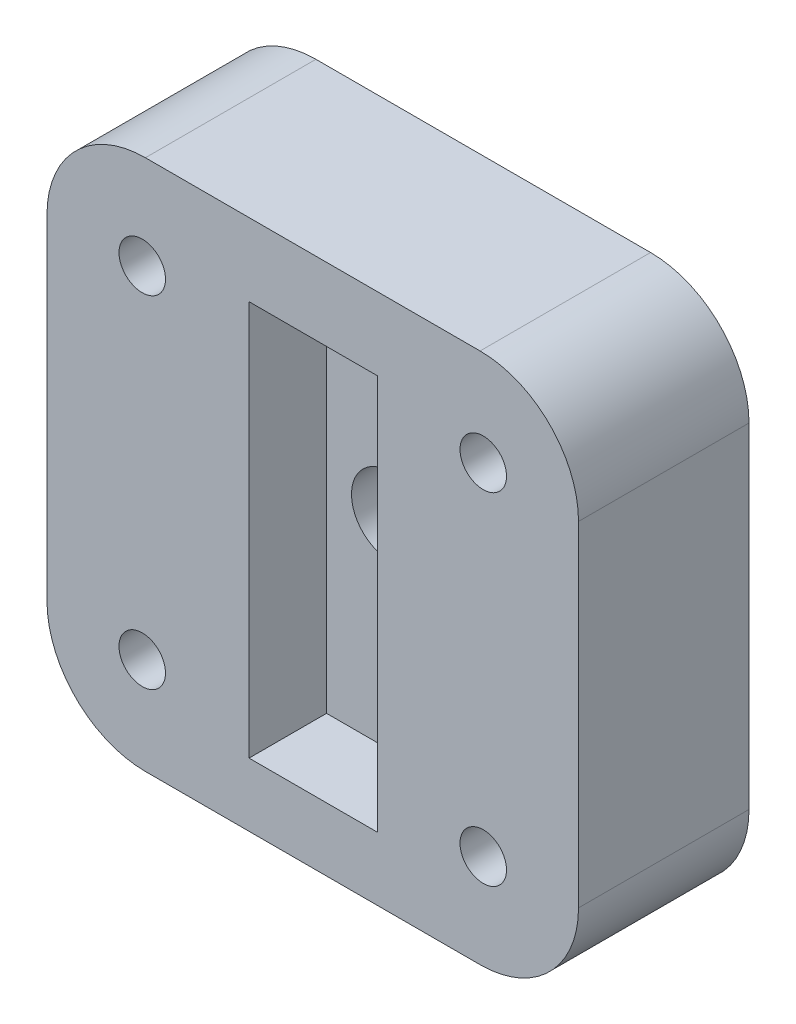
ISO-10303-21;
HEADER;
FILE_DESCRIPTION(('STEP AP214'),'2;1');
FILE_NAME('part.step','',(''),(''),'','','');
FILE_SCHEMA(('AUTOMOTIVE_DESIGN { 1 0 10303 214 1 1 1 1 }'));
ENDSEC;
DATA;
#1=APPLICATION_CONTEXT('core data for automotive mechanical design processes');
#2=APPLICATION_PROTOCOL_DEFINITION('international standard','automotive_design',2000,#1);
#3=PRODUCT_CONTEXT('',#1,'mechanical');
#4=PRODUCT('Part','Part','',(#3));
#5=PRODUCT_RELATED_PRODUCT_CATEGORY('part','',(#4));
#6=PRODUCT_DEFINITION_FORMATION('','',#4);
#7=PRODUCT_DEFINITION_CONTEXT('part definition',#1,'design');
#8=PRODUCT_DEFINITION('design','',#6,#7);
#9=PRODUCT_DEFINITION_SHAPE('','',#8);
#10=(LENGTH_UNIT() NAMED_UNIT(*) SI_UNIT(.MILLI.,.METRE.));
#11=(NAMED_UNIT(*) PLANE_ANGLE_UNIT() SI_UNIT($,.RADIAN.));
#12=(NAMED_UNIT(*) SI_UNIT($,.STERADIAN.) SOLID_ANGLE_UNIT());
#13=UNCERTAINTY_MEASURE_WITH_UNIT(LENGTH_MEASURE(1.E-05),#10,'distance_accuracy_value','');
#14=(GEOMETRIC_REPRESENTATION_CONTEXT(3) GLOBAL_UNCERTAINTY_ASSIGNED_CONTEXT((#13)) GLOBAL_UNIT_ASSIGNED_CONTEXT((#10,
#11,#12)) REPRESENTATION_CONTEXT('',''));
#15=CARTESIAN_POINT('',(0.,0.,0.));
#16=DIRECTION('',(0.,0.,1.));
#17=DIRECTION('',(1.,0.,0.));
#18=AXIS2_PLACEMENT_3D('',#15,#16,#17);
#19=CARTESIAN_POINT('',(0.,0.,0.999999999999999));
#20=DIRECTION('',(0.,0.,1.));
#21=DIRECTION('',(1.,0.,0.));
#22=AXIS2_PLACEMENT_3D('',#19,#20,#21);
#23=CYLINDRICAL_SURFACE('',#22,2.5);
#24=CARTESIAN_POINT('',(0.,0.,6.));
#25=DIRECTION('',(0.,0.,1.));
#26=DIRECTION('',(1.,0.,0.));
#27=AXIS2_PLACEMENT_3D('',#24,#25,#26);
#28=CIRCLE('',#27,2.5);
#29=CARTESIAN_POINT('',(2.5,0.,6.));
#30=VERTEX_POINT('',#29);
#31=EDGE_CURVE('E153',#30,#30,#28,.T.);
#32=ORIENTED_EDGE('',*,*,#31,.T.);
#33=EDGE_LOOP('',(#32));
#34=FACE_BOUND('',#33,.T.);
#35=CARTESIAN_POINT('',(0.,0.,3.));
#36=DIRECTION('',(0.,0.,-1.));
#37=DIRECTION('',(-1.,0.,0.));
#38=AXIS2_PLACEMENT_3D('',#35,#36,#37);
#39=CIRCLE('',#38,2.5);
#40=CARTESIAN_POINT('',(-2.5,0.,3.));
#41=VERTEX_POINT('',#40);
#42=EDGE_CURVE('E215',#41,#41,#39,.F.);
#43=ORIENTED_EDGE('',*,*,#42,.F.);
#44=EDGE_LOOP('',(#43));
#45=FACE_BOUND('',#44,.T.);
#46=ADVANCED_FACE('F32',(#34,#45),#23,.F.);
#47=CARTESIAN_POINT('',(17.145,0.,11.));
#48=DIRECTION('',(1.,0.,0.));
#49=DIRECTION('',(0.,0.,-1.));
#50=AXIS2_PLACEMENT_3D('',#47,#48,#49);
#51=PLANE('',#50);
#52=DIRECTION('',(0.,-1.,0.));
#53=VECTOR('',#52,1.);
#54=CARTESIAN_POINT('',(17.145,0.,11.));
#55=LINE('',#54,#53);
#56=CARTESIAN_POINT('',(17.145,10.795,11.));
#57=VERTEX_POINT('',#56);
#58=CARTESIAN_POINT('',(17.145,-10.795,11.));
#59=VERTEX_POINT('',#58);
#60=EDGE_CURVE('E182',#57,#59,#55,.T.);
#61=ORIENTED_EDGE('',*,*,#60,.T.);
#62=DIRECTION('',(0.,0.,-1.));
#63=VECTOR('',#62,1.);
#64=CARTESIAN_POINT('',(17.145,-10.795,0.));
#65=LINE('',#64,#63);
#66=CARTESIAN_POINT('',(17.145,-10.795,0.));
#67=VERTEX_POINT('',#66);
#68=EDGE_CURVE('E220',#59,#67,#65,.T.);
#69=ORIENTED_EDGE('',*,*,#68,.T.);
#70=DIRECTION('',(0.,-1.,0.));
#71=VECTOR('',#70,1.);
#72=CARTESIAN_POINT('',(17.145,0.,0.));
#73=LINE('',#72,#71);
#74=CARTESIAN_POINT('',(17.145,10.795,0.));
#75=VERTEX_POINT('',#74);
#76=EDGE_CURVE('E205',#75,#67,#73,.T.);
#77=ORIENTED_EDGE('',*,*,#76,.F.);
#78=DIRECTION('',(0.,0.,-1.));
#79=VECTOR('',#78,1.);
#80=CARTESIAN_POINT('',(17.145,10.795,11.));
#81=LINE('',#80,#79);
#82=EDGE_CURVE('E193',#75,#57,#81,.F.);
#83=ORIENTED_EDGE('',*,*,#82,.T.);
#84=EDGE_LOOP('',(#61,#69,#77,#83));
#85=FACE_BOUND('',#84,.T.);
#86=ADVANCED_FACE('F275',(#85),#51,.T.);
#87=CARTESIAN_POINT('',(0.,17.145,11.));
#88=DIRECTION('',(0.,1.,0.));
#89=DIRECTION('',(0.,0.,1.));
#90=AXIS2_PLACEMENT_3D('',#87,#88,#89);
#91=PLANE('',#90);
#92=DIRECTION('',(1.,0.,0.));
#93=VECTOR('',#92,1.);
#94=CARTESIAN_POINT('',(0.,17.145,11.));
#95=LINE('',#94,#93);
#96=CARTESIAN_POINT('',(-10.795,17.145,11.));
#97=VERTEX_POINT('',#96);
#98=CARTESIAN_POINT('',(10.795,17.145,11.));
#99=VERTEX_POINT('',#98);
#100=EDGE_CURVE('E185',#97,#99,#95,.T.);
#101=ORIENTED_EDGE('',*,*,#100,.T.);
#102=DIRECTION('',(0.,0.,-1.));
#103=VECTOR('',#102,1.);
#104=CARTESIAN_POINT('',(10.795,17.145,11.));
#105=LINE('',#104,#103);
#106=CARTESIAN_POINT('',(10.795,17.145,0.));
#107=VERTEX_POINT('',#106);
#108=EDGE_CURVE('E11',#99,#107,#105,.T.);
#109=ORIENTED_EDGE('',*,*,#108,.T.);
#110=DIRECTION('',(1.,0.,0.));
#111=VECTOR('',#110,1.);
#112=CARTESIAN_POINT('',(0.,17.145,0.));
#113=LINE('',#112,#111);
#114=CARTESIAN_POINT('',(-10.795,17.145,0.));
#115=VERTEX_POINT('',#114);
#116=EDGE_CURVE('E208',#115,#107,#113,.T.);
#117=ORIENTED_EDGE('',*,*,#116,.F.);
#118=DIRECTION('',(0.,0.,-1.));
#119=VECTOR('',#118,1.);
#120=CARTESIAN_POINT('',(-10.795,17.145,11.));
#121=LINE('',#120,#119);
#122=EDGE_CURVE('E40',#115,#97,#121,.F.);
#123=ORIENTED_EDGE('',*,*,#122,.T.);
#124=EDGE_LOOP('',(#101,#109,#117,#123));
#125=FACE_BOUND('',#124,.T.);
#126=ADVANCED_FACE('F249',(#125),#91,.T.);
#127=CARTESIAN_POINT('',(-17.145,0.,11.));
#128=DIRECTION('',(1.,0.,0.));
#129=DIRECTION('',(0.,1.,0.));
#130=AXIS2_PLACEMENT_3D('',#127,#128,#129);
#131=PLANE('',#130);
#132=DIRECTION('',(0.,-1.,0.));
#133=VECTOR('',#132,1.);
#134=CARTESIAN_POINT('',(-17.145,0.,0.));
#135=LINE('',#134,#133);
#136=CARTESIAN_POINT('',(-17.145,10.795,0.));
#137=VERTEX_POINT('',#136);
#138=CARTESIAN_POINT('',(-17.145,-10.795,0.));
#139=VERTEX_POINT('',#138);
#140=EDGE_CURVE('E211',#137,#139,#135,.T.);
#141=ORIENTED_EDGE('',*,*,#140,.T.);
#142=DIRECTION('',(0.,0.,-1.));
#143=VECTOR('',#142,1.);
#144=CARTESIAN_POINT('',(-17.145,-10.795,11.));
#145=LINE('',#144,#143);
#146=CARTESIAN_POINT('',(-17.145,-10.795,11.));
#147=VERTEX_POINT('',#146);
#148=EDGE_CURVE('E47',#139,#147,#145,.F.);
#149=ORIENTED_EDGE('',*,*,#148,.T.);
#150=DIRECTION('',(0.,-1.,0.));
#151=VECTOR('',#150,1.);
#152=CARTESIAN_POINT('',(-17.145,0.,11.));
#153=LINE('',#152,#151);
#154=CARTESIAN_POINT('',(-17.145,10.795,11.));
#155=VERTEX_POINT('',#154);
#156=EDGE_CURVE('E188',#155,#147,#153,.T.);
#157=ORIENTED_EDGE('',*,*,#156,.F.);
#158=DIRECTION('',(0.,0.,-1.));
#159=VECTOR('',#158,1.);
#160=CARTESIAN_POINT('',(-17.145,10.795,0.));
#161=LINE('',#160,#159);
#162=EDGE_CURVE('E243',#155,#137,#161,.T.);
#163=ORIENTED_EDGE('',*,*,#162,.T.);
#164=EDGE_LOOP('',(#141,#149,#157,#163));
#165=FACE_BOUND('',#164,.T.);
#166=ADVANCED_FACE('F257',(#165),#131,.F.);
#167=CARTESIAN_POINT('',(11.,11.,11.));
#168=DIRECTION('',(0.,0.,-1.));
#169=DIRECTION('',(-1.,0.,0.));
#170=AXIS2_PLACEMENT_3D('',#167,#168,#169);
#171=CYLINDRICAL_SURFACE('',#170,1.5);
#172=CARTESIAN_POINT('',(11.,11.,11.));
#173=DIRECTION('',(0.,0.,1.));
#174=DIRECTION('',(1.,0.,0.));
#175=AXIS2_PLACEMENT_3D('',#172,#173,#174);
#176=CIRCLE('',#175,1.5);
#177=CARTESIAN_POINT('',(12.5,11.,11.));
#178=VERTEX_POINT('',#177);
#179=EDGE_CURVE('E179',#178,#178,#176,.T.);
#180=ORIENTED_EDGE('',*,*,#179,.T.);
#181=EDGE_LOOP('',(#180));
#182=FACE_BOUND('',#181,.T.);
#183=CARTESIAN_POINT('',(11.,11.,0.));
#184=DIRECTION('',(0.,0.,1.));
#185=DIRECTION('',(1.,0.,0.));
#186=AXIS2_PLACEMENT_3D('',#183,#184,#185);
#187=CIRCLE('',#186,1.5);
#188=CARTESIAN_POINT('',(12.5,11.,0.));
#189=VERTEX_POINT('',#188);
#190=EDGE_CURVE('E202',#189,#189,#187,.T.);
#191=ORIENTED_EDGE('',*,*,#190,.F.);
#192=EDGE_LOOP('',(#191));
#193=FACE_BOUND('',#192,.T.);
#194=ADVANCED_FACE('F325',(#182,#193),#171,.F.);
#195=CARTESIAN_POINT('',(11.,-11.,11.));
#196=DIRECTION('',(0.,0.,-1.));
#197=DIRECTION('',(-1.,0.,0.));
#198=AXIS2_PLACEMENT_3D('',#195,#196,#197);
#199=CYLINDRICAL_SURFACE('',#198,1.5);
#200=CARTESIAN_POINT('',(11.,-11.,11.));
#201=DIRECTION('',(0.,0.,1.));
#202=DIRECTION('',(1.,0.,0.));
#203=AXIS2_PLACEMENT_3D('',#200,#201,#202);
#204=CIRCLE('',#203,1.5);
#205=CARTESIAN_POINT('',(12.5,-11.,11.));
#206=VERTEX_POINT('',#205);
#207=EDGE_CURVE('E176',#206,#206,#204,.T.);
#208=ORIENTED_EDGE('',*,*,#207,.T.);
#209=EDGE_LOOP('',(#208));
#210=FACE_BOUND('',#209,.T.);
#211=CARTESIAN_POINT('',(11.,-11.,0.));
#212=DIRECTION('',(0.,0.,1.));
#213=DIRECTION('',(1.,0.,0.));
#214=AXIS2_PLACEMENT_3D('',#211,#212,#213);
#215=CIRCLE('',#214,1.5);
#216=CARTESIAN_POINT('',(12.5,-11.,0.));
#217=VERTEX_POINT('',#216);
#218=EDGE_CURVE('E199',#217,#217,#215,.T.);
#219=ORIENTED_EDGE('',*,*,#218,.F.);
#220=EDGE_LOOP('',(#219));
#221=FACE_BOUND('',#220,.T.);
#222=ADVANCED_FACE('F330',(#210,#221),#199,.F.);
#223=CARTESIAN_POINT('',(-11.,11.,11.));
#224=DIRECTION('',(0.,0.,-1.));
#225=DIRECTION('',(-1.,0.,0.));
#226=AXIS2_PLACEMENT_3D('',#223,#224,#225);
#227=CYLINDRICAL_SURFACE('',#226,1.5);
#228=CARTESIAN_POINT('',(-11.,11.,11.));
#229=DIRECTION('',(0.,0.,1.));
#230=DIRECTION('',(1.,0.,0.));
#231=AXIS2_PLACEMENT_3D('',#228,#229,#230);
#232=CIRCLE('',#231,1.5);
#233=CARTESIAN_POINT('',(-9.5,11.,11.));
#234=VERTEX_POINT('',#233);
#235=EDGE_CURVE('E172',#234,#234,#232,.T.);
#236=ORIENTED_EDGE('',*,*,#235,.T.);
#237=EDGE_LOOP('',(#236));
#238=FACE_BOUND('',#237,.T.);
#239=CARTESIAN_POINT('',(-11.,11.,0.));
#240=DIRECTION('',(0.,0.,1.));
#241=DIRECTION('',(1.,0.,0.));
#242=AXIS2_PLACEMENT_3D('',#239,#240,#241);
#243=CIRCLE('',#242,1.5);
#244=CARTESIAN_POINT('',(-9.5,11.,0.));
#245=VERTEX_POINT('',#244);
#246=EDGE_CURVE('E196',#245,#245,#243,.T.);
#247=ORIENTED_EDGE('',*,*,#246,.F.);
#248=EDGE_LOOP('',(#247));
#249=FACE_BOUND('',#248,.T.);
#250=ADVANCED_FACE('F334',(#238,#249),#227,.F.);
#251=CARTESIAN_POINT('',(-11.,-11.,11.));
#252=DIRECTION('',(0.,0.,-1.));
#253=DIRECTION('',(-1.,0.,0.));
#254=AXIS2_PLACEMENT_3D('',#251,#252,#253);
#255=CYLINDRICAL_SURFACE('',#254,1.5);
#256=CARTESIAN_POINT('',(-11.,-11.,11.));
#257=DIRECTION('',(0.,0.,1.));
#258=DIRECTION('',(1.,0.,0.));
#259=AXIS2_PLACEMENT_3D('',#256,#257,#258);
#260=CIRCLE('',#259,1.5);
#261=CARTESIAN_POINT('',(-9.5,-11.,11.));
#262=VERTEX_POINT('',#261);
#263=EDGE_CURVE('E169',#262,#262,#260,.T.);
#264=ORIENTED_EDGE('',*,*,#263,.T.);
#265=EDGE_LOOP('',(#264));
#266=FACE_BOUND('',#265,.T.);
#267=CARTESIAN_POINT('',(-11.,-11.,0.));
#268=DIRECTION('',(0.,0.,1.));
#269=DIRECTION('',(1.,0.,0.));
#270=AXIS2_PLACEMENT_3D('',#267,#268,#269);
#271=CIRCLE('',#270,1.5);
#272=CARTESIAN_POINT('',(-9.5,-11.,0.));
#273=VERTEX_POINT('',#272);
#274=EDGE_CURVE('E165',#273,#273,#271,.T.);
#275=ORIENTED_EDGE('',*,*,#274,.F.);
#276=EDGE_LOOP('',(#275));
#277=FACE_BOUND('',#276,.T.);
#278=ADVANCED_FACE('F322',(#266,#277),#255,.F.);
#279=CARTESIAN_POINT('',(0.,-17.145,11.));
#280=DIRECTION('',(0.,1.,0.));
#281=DIRECTION('',(0.,0.,1.));
#282=AXIS2_PLACEMENT_3D('',#279,#280,#281);
#283=PLANE('',#282);
#284=DIRECTION('',(1.,0.,0.));
#285=VECTOR('',#284,1.);
#286=CARTESIAN_POINT('',(0.,-17.145,0.));
#287=LINE('',#286,#285);
#288=CARTESIAN_POINT('',(-10.795,-17.145,0.));
#289=VERTEX_POINT('',#288);
#290=CARTESIAN_POINT('',(10.795,-17.145,0.));
#291=VERTEX_POINT('',#290);
#292=EDGE_CURVE('E173',#289,#291,#287,.T.);
#293=ORIENTED_EDGE('',*,*,#292,.T.);
#294=DIRECTION('',(0.,0.,-1.));
#295=VECTOR('',#294,1.);
#296=CARTESIAN_POINT('',(10.795,-17.145,11.));
#297=LINE('',#296,#295);
#298=CARTESIAN_POINT('',(10.795,-17.145,11.));
#299=VERTEX_POINT('',#298);
#300=EDGE_CURVE('E234',#291,#299,#297,.F.);
#301=ORIENTED_EDGE('',*,*,#300,.T.);
#302=DIRECTION('',(1.,0.,0.));
#303=VECTOR('',#302,1.);
#304=CARTESIAN_POINT('',(0.,-17.145,11.));
#305=LINE('',#304,#303);
#306=CARTESIAN_POINT('',(-10.795,-17.145,11.));
#307=VERTEX_POINT('',#306);
#308=EDGE_CURVE('E190',#307,#299,#305,.T.);
#309=ORIENTED_EDGE('',*,*,#308,.F.);
#310=DIRECTION('',(0.,0.,-1.));
#311=VECTOR('',#310,1.);
#312=CARTESIAN_POINT('',(-10.795,-17.145,11.));
#313=LINE('',#312,#311);
#314=EDGE_CURVE('E231',#307,#289,#313,.T.);
#315=ORIENTED_EDGE('',*,*,#314,.T.);
#316=EDGE_LOOP('',(#293,#301,#309,#315));
#317=FACE_BOUND('',#316,.T.);
#318=ADVANCED_FACE('F267',(#317),#283,.F.);
#319=CARTESIAN_POINT('',(0.,0.,11.));
#320=DIRECTION('',(0.,0.,1.));
#321=DIRECTION('',(1.,0.,0.));
#322=AXIS2_PLACEMENT_3D('',#319,#320,#321);
#323=PLANE('',#322);
#324=DIRECTION('',(0.,-1.,0.));
#325=VECTOR('',#324,1.);
#326=CARTESIAN_POINT('',(-4.109,12.446,11.));
#327=LINE('',#326,#325);
#328=CARTESIAN_POINT('',(-4.109,12.446,11.));
#329=VERTEX_POINT('',#328);
#330=CARTESIAN_POINT('',(-4.109,-13.054,11.));
#331=VERTEX_POINT('',#330);
#332=EDGE_CURVE('E130',#329,#331,#327,.T.);
#333=ORIENTED_EDGE('',*,*,#332,.F.);
#334=DIRECTION('',(-1.,0.,0.));
#335=VECTOR('',#334,1.);
#336=CARTESIAN_POINT('',(-4.109,12.446,11.));
#337=LINE('',#336,#335);
#338=CARTESIAN_POINT('',(4.191,12.446,11.));
#339=VERTEX_POINT('',#338);
#340=EDGE_CURVE('E147',#339,#329,#337,.T.);
#341=ORIENTED_EDGE('',*,*,#340,.F.);
#342=DIRECTION('',(0.,1.,0.));
#343=VECTOR('',#342,1.);
#344=CARTESIAN_POINT('',(4.191,12.446,11.));
#345=LINE('',#344,#343);
#346=CARTESIAN_POINT('',(4.191,-13.054,11.));
#347=VERTEX_POINT('',#346);
#348=EDGE_CURVE('E150',#347,#339,#345,.T.);
#349=ORIENTED_EDGE('',*,*,#348,.F.);
#350=DIRECTION('',(1.,0.,0.));
#351=VECTOR('',#350,1.);
#352=CARTESIAN_POINT('',(-4.109,-13.054,11.));
#353=LINE('',#352,#351);
#354=EDGE_CURVE('E159',#331,#347,#353,.T.);
#355=ORIENTED_EDGE('',*,*,#354,.F.);
#356=EDGE_LOOP('',(#333,#341,#349,#355));
#357=FACE_BOUND('',#356,.T.);
#358=ORIENTED_EDGE('',*,*,#263,.F.);
#359=EDGE_LOOP('',(#358));
#360=FACE_BOUND('',#359,.T.);
#361=ORIENTED_EDGE('',*,*,#235,.F.);
#362=EDGE_LOOP('',(#361));
#363=FACE_BOUND('',#362,.T.);
#364=ORIENTED_EDGE('',*,*,#207,.F.);
#365=EDGE_LOOP('',(#364));
#366=FACE_BOUND('',#365,.T.);
#367=ORIENTED_EDGE('',*,*,#179,.F.);
#368=EDGE_LOOP('',(#367));
#369=FACE_BOUND('',#368,.T.);
#370=ORIENTED_EDGE('',*,*,#308,.T.);
#371=CARTESIAN_POINT('',(10.795,-10.795,11.));
#372=DIRECTION('',(0.,0.,1.));
#373=DIRECTION('',(1.,0.,0.));
#374=AXIS2_PLACEMENT_3D('',#371,#372,#373);
#375=CIRCLE('',#374,6.35);
#376=EDGE_CURVE('E241',#299,#59,#375,.T.);
#377=ORIENTED_EDGE('',*,*,#376,.T.);
#378=ORIENTED_EDGE('',*,*,#60,.F.);
#379=CARTESIAN_POINT('',(10.795,10.795,11.));
#380=DIRECTION('',(0.,0.,1.));
#381=DIRECTION('',(1.,0.,0.));
#382=AXIS2_PLACEMENT_3D('',#379,#380,#381);
#383=CIRCLE('',#382,6.35);
#384=EDGE_CURVE('E237',#57,#99,#383,.T.);
#385=ORIENTED_EDGE('',*,*,#384,.T.);
#386=ORIENTED_EDGE('',*,*,#100,.F.);
#387=CARTESIAN_POINT('',(-10.795,10.795,11.));
#388=DIRECTION('',(0.,0.,1.));
#389=DIRECTION('',(1.,0.,0.));
#390=AXIS2_PLACEMENT_3D('',#387,#388,#389);
#391=CIRCLE('',#390,6.35);
#392=EDGE_CURVE('E54',#97,#155,#391,.T.);
#393=ORIENTED_EDGE('',*,*,#392,.T.);
#394=ORIENTED_EDGE('',*,*,#156,.T.);
#395=CARTESIAN_POINT('',(-10.795,-10.795,11.));
#396=DIRECTION('',(0.,0.,1.));
#397=DIRECTION('',(1.,0.,0.));
#398=AXIS2_PLACEMENT_3D('',#395,#396,#397);
#399=CIRCLE('',#398,6.35);
#400=EDGE_CURVE('E239',#147,#307,#399,.T.);
#401=ORIENTED_EDGE('',*,*,#400,.T.);
#402=EDGE_LOOP('',(#370,#377,#378,#385,#386,#393,#394,#401));
#403=FACE_BOUND('',#402,.T.);
#404=ADVANCED_FACE('F252',(#357,#360,#363,#366,#369,#403),#323,.T.);
#405=CARTESIAN_POINT('',(0.,0.,0.));
#406=DIRECTION('',(0.,0.,1.));
#407=DIRECTION('',(1.,0.,0.));
#408=AXIS2_PLACEMENT_3D('',#405,#406,#407);
#409=PLANE('',#408);
#410=CARTESIAN_POINT('',(0.,0.,0.));
#411=DIRECTION('',(0.,0.,-1.));
#412=DIRECTION('',(-1.,0.,0.));
#413=AXIS2_PLACEMENT_3D('',#410,#411,#412);
#414=CIRCLE('',#413,4.15);
#415=CARTESIAN_POINT('',(-4.15,0.,0.));
#416=VERTEX_POINT('',#415);
#417=EDGE_CURVE('E356',#416,#416,#414,.T.);
#418=ORIENTED_EDGE('',*,*,#417,.F.);
#419=EDGE_LOOP('',(#418));
#420=FACE_BOUND('',#419,.T.);
#421=ORIENTED_EDGE('',*,*,#274,.T.);
#422=EDGE_LOOP('',(#421));
#423=FACE_BOUND('',#422,.T.);
#424=ORIENTED_EDGE('',*,*,#246,.T.);
#425=EDGE_LOOP('',(#424));
#426=FACE_BOUND('',#425,.T.);
#427=ORIENTED_EDGE('',*,*,#218,.T.);
#428=EDGE_LOOP('',(#427));
#429=FACE_BOUND('',#428,.T.);
#430=ORIENTED_EDGE('',*,*,#190,.T.);
#431=EDGE_LOOP('',(#430));
#432=FACE_BOUND('',#431,.T.);
#433=ORIENTED_EDGE('',*,*,#76,.T.);
#434=CARTESIAN_POINT('',(10.795,-10.795,0.));
#435=DIRECTION('',(0.,0.,1.));
#436=DIRECTION('',(1.,0.,0.));
#437=AXIS2_PLACEMENT_3D('',#434,#435,#436);
#438=CIRCLE('',#437,6.35);
#439=EDGE_CURVE('E229',#67,#291,#438,.F.);
#440=ORIENTED_EDGE('',*,*,#439,.T.);
#441=ORIENTED_EDGE('',*,*,#292,.F.);
#442=CARTESIAN_POINT('',(-10.795,-10.795,0.));
#443=DIRECTION('',(0.,0.,1.));
#444=DIRECTION('',(1.,0.,0.));
#445=AXIS2_PLACEMENT_3D('',#442,#443,#444);
#446=CIRCLE('',#445,6.35);
#447=EDGE_CURVE('E227',#289,#139,#446,.F.);
#448=ORIENTED_EDGE('',*,*,#447,.T.);
#449=ORIENTED_EDGE('',*,*,#140,.F.);
#450=CARTESIAN_POINT('',(-10.795,10.795,0.));
#451=DIRECTION('',(0.,0.,1.));
#452=DIRECTION('',(1.,0.,0.));
#453=AXIS2_PLACEMENT_3D('',#450,#451,#452);
#454=CIRCLE('',#453,6.35);
#455=EDGE_CURVE('E223',#137,#115,#454,.F.);
#456=ORIENTED_EDGE('',*,*,#455,.T.);
#457=ORIENTED_EDGE('',*,*,#116,.T.);
#458=CARTESIAN_POINT('',(10.795,10.795,0.));
#459=DIRECTION('',(0.,0.,1.));
#460=DIRECTION('',(1.,0.,0.));
#461=AXIS2_PLACEMENT_3D('',#458,#459,#460);
#462=CIRCLE('',#461,6.35);
#463=EDGE_CURVE('E225',#107,#75,#462,.F.);
#464=ORIENTED_EDGE('',*,*,#463,.T.);
#465=EDGE_LOOP('',(#433,#440,#441,#448,#449,#456,#457,#464));
#466=FACE_BOUND('',#465,.T.);
#467=ADVANCED_FACE('F259',(#420,#423,#426,#429,#432,#466),#409,.F.);
#468=CARTESIAN_POINT('',(-4.109,12.446,6.));
#469=DIRECTION('',(-1.,0.,0.));
#470=DIRECTION('',(0.,-1.,0.));
#471=AXIS2_PLACEMENT_3D('',#468,#469,#470);
#472=PLANE('',#471);
#473=ORIENTED_EDGE('',*,*,#332,.T.);
#474=DIRECTION('',(0.,0.,1.));
#475=VECTOR('',#474,1.);
#476=CARTESIAN_POINT('',(-4.109,-13.054,6.));
#477=LINE('',#476,#475);
#478=CARTESIAN_POINT('',(-4.109,-13.054,6.));
#479=VERTEX_POINT('',#478);
#480=EDGE_CURVE('E123',#479,#331,#477,.T.);
#481=ORIENTED_EDGE('',*,*,#480,.F.);
#482=DIRECTION('',(0.,-1.,0.));
#483=VECTOR('',#482,1.);
#484=CARTESIAN_POINT('',(-4.109,12.446,6.));
#485=LINE('',#484,#483);
#486=CARTESIAN_POINT('',(-4.109,12.446,6.));
#487=VERTEX_POINT('',#486);
#488=EDGE_CURVE('E127',#487,#479,#485,.T.);
#489=ORIENTED_EDGE('',*,*,#488,.F.);
#490=DIRECTION('',(0.,0.,1.));
#491=VECTOR('',#490,1.);
#492=CARTESIAN_POINT('',(-4.109,12.446,6.));
#493=LINE('',#492,#491);
#494=EDGE_CURVE('E163',#487,#329,#493,.T.);
#495=ORIENTED_EDGE('',*,*,#494,.T.);
#496=EDGE_LOOP('',(#473,#481,#489,#495));
#497=FACE_BOUND('',#496,.T.);
#498=ADVANCED_FACE('F125',(#497),#472,.F.);
#499=CARTESIAN_POINT('',(-4.109,12.446,6.));
#500=DIRECTION('',(0.,1.,0.));
#501=DIRECTION('',(0.,0.,1.));
#502=AXIS2_PLACEMENT_3D('',#499,#500,#501);
#503=PLANE('',#502);
#504=ORIENTED_EDGE('',*,*,#340,.T.);
#505=ORIENTED_EDGE('',*,*,#494,.F.);
#506=DIRECTION('',(-1.,0.,0.));
#507=VECTOR('',#506,1.);
#508=CARTESIAN_POINT('',(-4.109,12.446,6.));
#509=LINE('',#508,#507);
#510=CARTESIAN_POINT('',(4.191,12.446,6.));
#511=VERTEX_POINT('',#510);
#512=EDGE_CURVE('E135',#511,#487,#509,.T.);
#513=ORIENTED_EDGE('',*,*,#512,.F.);
#514=DIRECTION('',(0.,0.,1.));
#515=VECTOR('',#514,1.);
#516=CARTESIAN_POINT('',(4.191,12.446,6.));
#517=LINE('',#516,#515);
#518=EDGE_CURVE('E166',#511,#339,#517,.T.);
#519=ORIENTED_EDGE('',*,*,#518,.T.);
#520=EDGE_LOOP('',(#504,#505,#513,#519));
#521=FACE_BOUND('',#520,.T.);
#522=ADVANCED_FACE('F302',(#521),#503,.F.);
#523=CARTESIAN_POINT('',(4.191,12.446,6.));
#524=DIRECTION('',(1.,0.,0.));
#525=DIRECTION('',(0.,1.,0.));
#526=AXIS2_PLACEMENT_3D('',#523,#524,#525);
#527=PLANE('',#526);
#528=ORIENTED_EDGE('',*,*,#348,.T.);
#529=ORIENTED_EDGE('',*,*,#518,.F.);
#530=DIRECTION('',(0.,1.,0.));
#531=VECTOR('',#530,1.);
#532=CARTESIAN_POINT('',(4.191,12.446,6.));
#533=LINE('',#532,#531);
#534=CARTESIAN_POINT('',(4.191,-13.054,6.));
#535=VERTEX_POINT('',#534);
#536=EDGE_CURVE('E143',#535,#511,#533,.T.);
#537=ORIENTED_EDGE('',*,*,#536,.F.);
#538=DIRECTION('',(0.,0.,1.));
#539=VECTOR('',#538,1.);
#540=CARTESIAN_POINT('',(4.191,-13.054,6.));
#541=LINE('',#540,#539);
#542=EDGE_CURVE('E134',#535,#347,#541,.T.);
#543=ORIENTED_EDGE('',*,*,#542,.T.);
#544=EDGE_LOOP('',(#528,#529,#537,#543));
#545=FACE_BOUND('',#544,.T.);
#546=ADVANCED_FACE('F305',(#545),#527,.F.);
#547=CARTESIAN_POINT('',(-4.109,-13.054,6.));
#548=DIRECTION('',(0.,-1.,0.));
#549=DIRECTION('',(1.,0.,0.));
#550=AXIS2_PLACEMENT_3D('',#547,#548,#549);
#551=PLANE('',#550);
#552=ORIENTED_EDGE('',*,*,#354,.T.);
#553=ORIENTED_EDGE('',*,*,#542,.F.);
#554=DIRECTION('',(1.,0.,0.));
#555=VECTOR('',#554,1.);
#556=CARTESIAN_POINT('',(-4.109,-13.054,6.));
#557=LINE('',#556,#555);
#558=EDGE_CURVE('E138',#479,#535,#557,.T.);
#559=ORIENTED_EDGE('',*,*,#558,.F.);
#560=ORIENTED_EDGE('',*,*,#480,.T.);
#561=EDGE_LOOP('',(#552,#553,#559,#560));
#562=FACE_BOUND('',#561,.T.);
#563=ADVANCED_FACE('F139',(#562),#551,.F.);
#564=CARTESIAN_POINT('',(0.,0.,6.));
#565=DIRECTION('',(0.,0.,1.));
#566=DIRECTION('',(1.,0.,0.));
#567=AXIS2_PLACEMENT_3D('',#564,#565,#566);
#568=PLANE('',#567);
#569=ORIENTED_EDGE('',*,*,#31,.F.);
#570=EDGE_LOOP('',(#569));
#571=FACE_BOUND('',#570,.T.);
#572=ORIENTED_EDGE('',*,*,#488,.T.);
#573=ORIENTED_EDGE('',*,*,#558,.T.);
#574=ORIENTED_EDGE('',*,*,#536,.T.);
#575=ORIENTED_EDGE('',*,*,#512,.T.);
#576=EDGE_LOOP('',(#572,#573,#574,#575));
#577=FACE_BOUND('',#576,.T.);
#578=ADVANCED_FACE('F145',(#571,#577),#568,.T.);
#579=CARTESIAN_POINT('',(0.,0.,3.));
#580=DIRECTION('',(0.,0.,-1.));
#581=DIRECTION('',(-1.,0.,0.));
#582=AXIS2_PLACEMENT_3D('',#579,#580,#581);
#583=PLANE('',#582);
#584=CARTESIAN_POINT('',(0.,0.,3.));
#585=DIRECTION('',(0.,0.,-1.));
#586=DIRECTION('',(-1.,0.,0.));
#587=AXIS2_PLACEMENT_3D('',#584,#585,#586);
#588=CIRCLE('',#587,4.15);
#589=CARTESIAN_POINT('',(-4.15,0.,3.));
#590=VERTEX_POINT('',#589);
#591=EDGE_CURVE('E218',#590,#590,#588,.T.);
#592=ORIENTED_EDGE('',*,*,#591,.T.);
#593=EDGE_LOOP('',(#592));
#594=FACE_BOUND('',#593,.T.);
#595=ORIENTED_EDGE('',*,*,#42,.T.);
#596=EDGE_LOOP('',(#595));
#597=FACE_BOUND('',#596,.T.);
#598=ADVANCED_FACE('F300',(#594,#597),#583,.T.);
#599=CARTESIAN_POINT('',(0.,0.,3.));
#600=DIRECTION('',(0.,0.,-1.));
#601=DIRECTION('',(-1.,0.,0.));
#602=AXIS2_PLACEMENT_3D('',#599,#600,#601);
#603=CYLINDRICAL_SURFACE('',#602,4.15);
#604=ORIENTED_EDGE('',*,*,#591,.F.);
#605=EDGE_LOOP('',(#604));
#606=FACE_BOUND('',#605,.T.);
#607=ORIENTED_EDGE('',*,*,#417,.T.);
#608=EDGE_LOOP('',(#607));
#609=FACE_BOUND('',#608,.T.);
#610=ADVANCED_FACE('F296',(#606,#609),#603,.F.);
#611=CARTESIAN_POINT('',(10.795,-10.795,11.));
#612=DIRECTION('',(0.,0.,1.));
#613=DIRECTION('',(1.,0.,0.));
#614=AXIS2_PLACEMENT_3D('',#611,#612,#613);
#615=CYLINDRICAL_SURFACE('',#614,6.35);
#616=ORIENTED_EDGE('',*,*,#376,.F.);
#617=ORIENTED_EDGE('',*,*,#300,.F.);
#618=ORIENTED_EDGE('',*,*,#439,.F.);
#619=ORIENTED_EDGE('',*,*,#68,.F.);
#620=EDGE_LOOP('',(#616,#617,#618,#619));
#621=FACE_BOUND('',#620,.T.);
#622=ADVANCED_FACE('F272',(#621),#615,.T.);
#623=CARTESIAN_POINT('',(-10.795,-10.795,11.));
#624=DIRECTION('',(0.,0.,-1.));
#625=DIRECTION('',(-1.,0.,0.));
#626=AXIS2_PLACEMENT_3D('',#623,#624,#625);
#627=CYLINDRICAL_SURFACE('',#626,6.35);
#628=ORIENTED_EDGE('',*,*,#400,.F.);
#629=ORIENTED_EDGE('',*,*,#148,.F.);
#630=ORIENTED_EDGE('',*,*,#447,.F.);
#631=ORIENTED_EDGE('',*,*,#314,.F.);
#632=EDGE_LOOP('',(#628,#629,#630,#631));
#633=FACE_BOUND('',#632,.T.);
#634=ADVANCED_FACE('F264',(#633),#627,.T.);
#635=CARTESIAN_POINT('',(10.795,10.795,11.));
#636=DIRECTION('',(0.,0.,-1.));
#637=DIRECTION('',(-1.,0.,0.));
#638=AXIS2_PLACEMENT_3D('',#635,#636,#637);
#639=CYLINDRICAL_SURFACE('',#638,6.35);
#640=ORIENTED_EDGE('',*,*,#384,.F.);
#641=ORIENTED_EDGE('',*,*,#82,.F.);
#642=ORIENTED_EDGE('',*,*,#463,.F.);
#643=ORIENTED_EDGE('',*,*,#108,.F.);
#644=EDGE_LOOP('',(#640,#641,#642,#643));
#645=FACE_BOUND('',#644,.T.);
#646=ADVANCED_FACE('F278',(#645),#639,.T.);
#647=CARTESIAN_POINT('',(-10.795,10.795,11.));
#648=DIRECTION('',(0.,0.,1.));
#649=DIRECTION('',(1.,0.,0.));
#650=AXIS2_PLACEMENT_3D('',#647,#648,#649);
#651=CYLINDRICAL_SURFACE('',#650,6.35);
#652=ORIENTED_EDGE('',*,*,#392,.F.);
#653=ORIENTED_EDGE('',*,*,#122,.F.);
#654=ORIENTED_EDGE('',*,*,#455,.F.);
#655=ORIENTED_EDGE('',*,*,#162,.F.);
#656=EDGE_LOOP('',(#652,#653,#654,#655));
#657=FACE_BOUND('',#656,.T.);
#658=ADVANCED_FACE('F34',(#657),#651,.T.);
#659=CLOSED_SHELL('',(#46,#86,#126,#166,#194,#222,#250,#278,#318,#404,#467,#498,#522,#546,#563,
#578,#598,#610,#622,#634,#646,#658));
#660=MANIFOLD_SOLID_BREP('B2',#659);
#661=ADVANCED_BREP_SHAPE_REPRESENTATION('',(#18,#660),#14);
#662=SHAPE_DEFINITION_REPRESENTATION(#9,#661);
ENDSEC;
END-ISO-10303-21;
